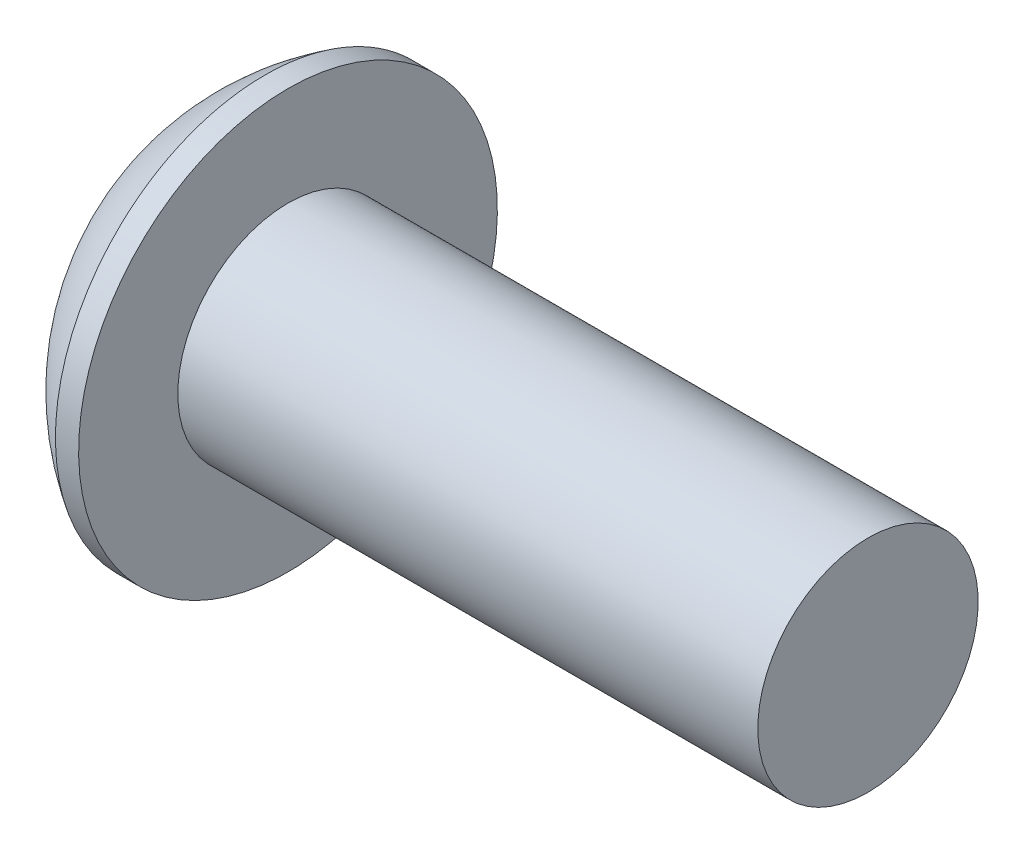
ISO-10303-21;
HEADER;
FILE_DESCRIPTION(('STEP AP214'),'2;1');
FILE_NAME('part.step','',(''),(''),'','','');
FILE_SCHEMA(('AUTOMOTIVE_DESIGN { 1 0 10303 214 1 1 1 1 }'));
ENDSEC;
DATA;
#1=APPLICATION_CONTEXT('core data for automotive mechanical design processes');
#2=APPLICATION_PROTOCOL_DEFINITION('international standard','automotive_design',2000,#1);
#3=PRODUCT_CONTEXT('',#1,'mechanical');
#4=PRODUCT('Part','Part','',(#3));
#5=PRODUCT_RELATED_PRODUCT_CATEGORY('part','',(#4));
#6=PRODUCT_DEFINITION_FORMATION('','',#4);
#7=PRODUCT_DEFINITION_CONTEXT('part definition',#1,'design');
#8=PRODUCT_DEFINITION('design','',#6,#7);
#9=PRODUCT_DEFINITION_SHAPE('','',#8);
#10=(LENGTH_UNIT() NAMED_UNIT(*) SI_UNIT(.MILLI.,.METRE.));
#11=(NAMED_UNIT(*) PLANE_ANGLE_UNIT() SI_UNIT($,.RADIAN.));
#12=(NAMED_UNIT(*) SI_UNIT($,.STERADIAN.) SOLID_ANGLE_UNIT());
#13=UNCERTAINTY_MEASURE_WITH_UNIT(LENGTH_MEASURE(1.E-05),#10,'distance_accuracy_value','');
#14=(GEOMETRIC_REPRESENTATION_CONTEXT(3) GLOBAL_UNCERTAINTY_ASSIGNED_CONTEXT((#13)) GLOBAL_UNIT_ASSIGNED_CONTEXT((#10,
#11,#12)) REPRESENTATION_CONTEXT('',''));
#15=CARTESIAN_POINT('',(0.,0.,0.));
#16=DIRECTION('',(0.,0.,1.));
#17=DIRECTION('',(1.,0.,0.));
#18=AXIS2_PLACEMENT_3D('',#15,#16,#17);
#19=CARTESIAN_POINT('',(-0.533400000000002,0.,0.));
#20=DIRECTION('',(-1.,0.,0.));
#21=DIRECTION('',(0.,0.,1.));
#22=AXIS2_PLACEMENT_3D('',#19,#20,#21);
#23=PLANE('',#22);
#24=DIRECTION('',(0.,0.5,0.866025403784439));
#25=VECTOR('',#24,1.);
#26=CARTESIAN_POINT('',(-0.533400000000002,1.83308710467706,0.));
#27=LINE('',#26,#25);
#28=CARTESIAN_POINT('',(-0.533400000000002,1.83308710467706,0.));
#29=VERTEX_POINT('',#28);
#30=CARTESIAN_POINT('',(-0.533400000000002,0.916543552338531,-1.5875));
#31=VERTEX_POINT('',#30);
#32=EDGE_CURVE('E115',#29,#31,#27,.F.);
#33=ORIENTED_EDGE('',*,*,#32,.T.);
#34=DIRECTION('',(0.,1.,0.));
#35=VECTOR('',#34,1.);
#36=CARTESIAN_POINT('',(-0.533400000000002,0.916543552338531,-1.5875));
#37=LINE('',#36,#35);
#38=CARTESIAN_POINT('',(-0.533400000000002,-0.916543552338531,-1.5875));
#39=VERTEX_POINT('',#38);
#40=EDGE_CURVE('E82',#31,#39,#37,.F.);
#41=ORIENTED_EDGE('',*,*,#40,.T.);
#42=DIRECTION('',(0.,0.5,-0.866025403784439));
#43=VECTOR('',#42,1.);
#44=CARTESIAN_POINT('',(-0.533400000000002,-0.916543552338531,-1.5875));
#45=LINE('',#44,#43);
#46=CARTESIAN_POINT('',(-0.533400000000002,-1.83308710467706,0.));
#47=VERTEX_POINT('',#46);
#48=EDGE_CURVE('E84',#39,#47,#45,.F.);
#49=ORIENTED_EDGE('',*,*,#48,.T.);
#50=DIRECTION('',(0.,-0.5,-0.866025403784439));
#51=VECTOR('',#50,1.);
#52=CARTESIAN_POINT('',(-0.533400000000002,-1.83308710467706,0.));
#53=LINE('',#52,#51);
#54=CARTESIAN_POINT('',(-0.533400000000002,-0.916543552338533,1.5875));
#55=VERTEX_POINT('',#54);
#56=EDGE_CURVE('E85',#47,#55,#53,.F.);
#57=ORIENTED_EDGE('',*,*,#56,.T.);
#58=DIRECTION('',(0.,-1.,0.));
#59=VECTOR('',#58,1.);
#60=CARTESIAN_POINT('',(-0.533400000000002,-0.916543552338532,1.5875));
#61=LINE('',#60,#59);
#62=CARTESIAN_POINT('',(-0.533400000000002,0.916543552338531,1.5875));
#63=VERTEX_POINT('',#62);
#64=EDGE_CURVE('E71',#55,#63,#61,.F.);
#65=ORIENTED_EDGE('',*,*,#64,.T.);
#66=DIRECTION('',(0.,-0.5,0.866025403784439));
#67=VECTOR('',#66,1.);
#68=CARTESIAN_POINT('',(-0.533400000000002,0.916543552338531,1.5875));
#69=LINE('',#68,#67);
#70=EDGE_CURVE('E110',#63,#29,#69,.F.);
#71=ORIENTED_EDGE('',*,*,#70,.T.);
#72=EDGE_LOOP('',(#33,#41,#49,#57,#65,#71));
#73=FACE_BOUND('',#72,.T.);
#74=ADVANCED_FACE('F17',(#73),#23,.T.);
#75=CARTESIAN_POINT('',(-0.533400000000002,-1.83308710467706,0.));
#76=DIRECTION('',(0.,-0.866025403784439,0.5));
#77=DIRECTION('',(0.,-0.5,-0.866025403784439));
#78=AXIS2_PLACEMENT_3D('',#75,#76,#77);
#79=PLANE('',#78);
#80=CARTESIAN_POINT('',(-2.56539999994394,-1.8330871046745,-2.00804498786736E-11));
#81=CARTESIAN_POINT('',(-2.53392818229741,-1.80158505518366,0.0545631502562923));
#82=CARTESIAN_POINT('',(-2.5043050627177,-1.76955629074211,0.110038597579172));
#83=CARTESIAN_POINT('',(-2.45006639539122,-1.70424635317817,0.223158727683824));
#84=CARTESIAN_POINT('',(-2.42548101615987,-1.6709589724711,0.280814162317604));
#85=CARTESIAN_POINT('',(-2.38336609605347,-1.60383660211837,0.397073518091736));
#86=CARTESIAN_POINT('',(-2.36573072948629,-1.57001869730198,0.455647847439699));
#87=CARTESIAN_POINT('',(-2.33856008862263,-1.50163859306838,0.574085662199493));
#88=CARTESIAN_POINT('',(-2.32900454007239,-1.46707848106388,0.633945532106421));
#89=CARTESIAN_POINT('',(-2.32038274183869,-1.40751253669323,0.737116774157155));
#90=CARTESIAN_POINT('',(-2.31910682172836,-1.38258360390154,0.780294952330845));
#91=CARTESIAN_POINT('',(-2.32125913780735,-1.33276652395073,0.866580665890379));
#92=CARTESIAN_POINT('',(-2.32468902284537,-1.30787839414808,0.90968817121394));
#93=CARTESIAN_POINT('',(-2.33605631415915,-1.25834345643267,0.995485200086784));
#94=CARTESIAN_POINT('',(-2.34399762019329,-1.23369687609494,1.03817432946455));
#95=CARTESIAN_POINT('',(-2.36395627681902,-1.18481740842653,1.12283605091316));
#96=CARTESIAN_POINT('',(-2.37597537628367,-1.16058470328902,1.16480832741616));
#97=CARTESIAN_POINT('',(-2.41164383187845,-1.09853862948576,1.27227527965358));
#98=CARTESIAN_POINT('',(-2.43797770752625,-1.06110942924036,1.33710455616529));
#99=CARTESIAN_POINT('',(-2.48243061452926,-1.00607390269188,1.43242888436855));
#100=CARTESIAN_POINT('',(-2.49804835924321,-0.987937988038022,1.46384120999077));
#101=CARTESIAN_POINT('',(-2.53070945051393,-0.951999508520197,1.52608848246242));
#102=CARTESIAN_POINT('',(-2.54775211871235,-0.934196789917587,1.55692369559499));
#103=CARTESIAN_POINT('',(-2.56539999993807,-0.916543552329633,1.58750000001541));
#104=B_SPLINE_CURVE_WITH_KNOTS('',3,(#80,#81,#82,#83,#84,#85,#86,#87,#88,#89,#90,#91,#92,#93,
#94,#95,#96,#97,#98,#99,#100,#101,#102,#103),.UNSPECIFIED.,.F.,.F.,(4,2,2,2,2,2,2,2,2,2,2,4),
(0.,0.211427927732169,0.424087197148228,0.633370156422424,0.842126401515785,0.991537201098734,
1.14100036552056,1.29059292577265,1.44024972414947,1.67781721417335,1.79627069411587,
1.91466809995991),.UNSPECIFIED.);
#105=CARTESIAN_POINT('',(-2.56539999993857,-1.83308710468646,0.));
#106=VERTEX_POINT('',#105);
#107=CARTESIAN_POINT('',(-2.56539999993106,-0.916543552342318,1.5875));
#108=VERTEX_POINT('',#107);
#109=EDGE_CURVE('E20',#106,#108,#104,.T.);
#110=ORIENTED_EDGE('',*,*,#109,.T.);
#111=DIRECTION('',(1.,0.,0.));
#112=VECTOR('',#111,1.);
#113=CARTESIAN_POINT('',(-0.533400000000002,-0.916543552338533,1.5875));
#114=LINE('',#113,#112);
#115=EDGE_CURVE('E90',#108,#55,#114,.T.);
#116=ORIENTED_EDGE('',*,*,#115,.T.);
#117=ORIENTED_EDGE('',*,*,#56,.F.);
#118=DIRECTION('',(1.,0.,0.));
#119=VECTOR('',#118,1.);
#120=CARTESIAN_POINT('',(-0.533400000000002,-1.83308710467706,0.));
#121=LINE('',#120,#119);
#122=EDGE_CURVE('E58',#47,#106,#121,.F.);
#123=ORIENTED_EDGE('',*,*,#122,.T.);
#124=EDGE_LOOP('',(#110,#116,#117,#123));
#125=FACE_BOUND('',#124,.T.);
#126=ADVANCED_FACE('F89',(#125),#79,.F.);
#127=CARTESIAN_POINT('',(-0.533400000000002,-0.916543552338531,-1.5875));
#128=DIRECTION('',(0.,-0.866025403784439,-0.5));
#129=DIRECTION('',(0.,0.5,-0.866025403784439));
#130=AXIS2_PLACEMENT_3D('',#127,#128,#129);
#131=PLANE('',#130);
#132=CARTESIAN_POINT('',(-2.56539999994527,-0.916543552319403,-1.58750000001409));
#133=CARTESIAN_POINT('',(-2.53392818229919,-0.948045601822691,-1.53293684974403));
#134=CARTESIAN_POINT('',(-2.50430506271949,-0.980074366269487,-1.47746140242354));
#135=CARTESIAN_POINT('',(-2.45006639539264,-1.04538430383757,-1.36434127232016));
#136=CARTESIAN_POINT('',(-2.42548101616093,-1.07867168454351,-1.30668583768523));
#137=CARTESIAN_POINT('',(-2.38336609605398,-1.14579405489574,-1.19042648190974));
#138=CARTESIAN_POINT('',(-2.36573072948662,-1.17961195971273,-1.13185215256154));
#139=CARTESIAN_POINT('',(-2.3385600886227,-1.2479920639471,-1.013414337801));
#140=CARTESIAN_POINT('',(-2.32900454007237,-1.28255217595175,-0.953554467893575));
#141=CARTESIAN_POINT('',(-2.32038274183866,-1.34211812032265,-0.850383225842316));
#142=CARTESIAN_POINT('',(-2.31910682172835,-1.36704705311438,-0.807205047668587));
#143=CARTESIAN_POINT('',(-2.32125913780739,-1.41686413306525,-0.720919334108961));
#144=CARTESIAN_POINT('',(-2.32468902284544,-1.44175226286793,-0.67781182878535));
#145=CARTESIAN_POINT('',(-2.33605631415929,-1.49128720058339,-0.592014799912417));
#146=CARTESIAN_POINT('',(-2.34399762019345,-1.51593378092113,-0.54932567053461));
#147=CARTESIAN_POINT('',(-2.36395627681926,-1.56481324858959,-0.464663949085931));
#148=CARTESIAN_POINT('',(-2.37597537628395,-1.58904595372712,-0.422691672582891));
#149=CARTESIAN_POINT('',(-2.41164383187876,-1.65109202753029,-0.315224720345625));
#150=CARTESIAN_POINT('',(-2.43797770752652,-1.6885212277756,-0.250395443834082));
#151=CARTESIAN_POINT('',(-2.48243061452944,-1.74355675432393,-0.15507111563107));
#152=CARTESIAN_POINT('',(-2.49804835924337,-1.76169266897775,-0.123658790008927));
#153=CARTESIAN_POINT('',(-2.53070945051401,-1.79763114849548,-0.0614115175374324));
#154=CARTESIAN_POINT('',(-2.5477521187124,-1.81543386709805,-0.0305763044049344));
#155=CARTESIAN_POINT('',(-2.56539999993807,-1.83308710468596,1.54136844652939E-11));
#156=B_SPLINE_CURVE_WITH_KNOTS('',3,(#132,#133,#134,#135,#136,#137,#138,#139,#140,#141,#142,
#143,#144,#145,#146,#147,#148,#149,#150,#151,#152,#153,#154,#155),.UNSPECIFIED.,.F.,.F.,(4,2,2,
2,2,2,2,2,2,2,2,4),(0.,0.211427927733669,0.424087197151313,0.633370156427101,0.842126401522016,
0.99153720110513,1.14100036552713,1.29059292577937,1.44024972415633,1.67781721417961,
1.79627069412184,1.9146680999656),.UNSPECIFIED.);
#157=CARTESIAN_POINT('',(-2.56539999995198,-0.916543552351339,-1.58750000002218));
#158=VERTEX_POINT('',#157);
#159=EDGE_CURVE('E94',#158,#106,#156,.T.);
#160=ORIENTED_EDGE('',*,*,#159,.T.);
#161=ORIENTED_EDGE('',*,*,#122,.F.);
#162=ORIENTED_EDGE('',*,*,#48,.F.);
#163=DIRECTION('',(-1.,0.,0.));
#164=VECTOR('',#163,1.);
#165=CARTESIAN_POINT('',(-0.533400000000002,-0.916543552338531,-1.5875));
#166=LINE('',#165,#164);
#167=EDGE_CURVE('E96',#39,#158,#166,.T.);
#168=ORIENTED_EDGE('',*,*,#167,.T.);
#169=EDGE_LOOP('',(#160,#161,#162,#168));
#170=FACE_BOUND('',#169,.T.);
#171=ADVANCED_FACE('F92',(#170),#131,.F.);
#172=CARTESIAN_POINT('',(-0.533400000000002,0.916543552338531,-1.5875));
#173=DIRECTION('',(0.,0.,-1.));
#174=DIRECTION('',(-1.,0.,0.));
#175=AXIS2_PLACEMENT_3D('',#172,#173,#174);
#176=PLANE('',#175);
#177=CARTESIAN_POINT('',(-2.56539999994527,0.916543552360294,-1.58749999999048));
#178=CARTESIAN_POINT('',(-2.53392818229821,0.853539453376781,-1.58749999999657));
#179=CARTESIAN_POINT('',(-2.50430506271702,0.789481924500113,-1.58749999999908));
#180=CARTESIAN_POINT('',(-2.45006639538581,0.658862049392287,-1.58750000000093));
#181=CARTESIAN_POINT('',(-2.42548101615122,0.59228728799181,-1.58750000000025));
#182=CARTESIAN_POINT('',(-2.38336609603683,0.458042547310979,-1.58749999999976));
#183=CARTESIAN_POINT('',(-2.36573072946494,0.390406737689213,-1.58749999999994));
#184=CARTESIAN_POINT('',(-2.3385600885904,0.253646529243895,-1.58750000000006));
#185=CARTESIAN_POINT('',(-2.32900454003397,0.184526305245804,-1.58750000000001));
#186=CARTESIAN_POINT('',(-2.32038274178942,0.0653944165301613,-1.58749999999999));
#187=CARTESIAN_POINT('',(-2.31910682167392,0.0155365509618711,-1.5875));
#188=CARTESIAN_POINT('',(-2.3212591377409,-0.0840976089101244,-1.5875));
#189=CARTESIAN_POINT('',(-2.32468902277208,-0.133873868500894,-1.5875));
#190=CARTESIAN_POINT('',(-2.33605631407098,-0.2329437439033,-1.5875));
#191=CARTESIAN_POINT('',(-2.34399762009707,-0.282236904564879,-1.5875));
#192=CARTESIAN_POINT('',(-2.36395627670599,-0.379995839874564,-1.5875));
#193=CARTESIAN_POINT('',(-2.37597537616188,-0.428461250136325,-1.5875));
#194=CARTESIAN_POINT('',(-2.41164383175616,-0.552553397787632,-1.5875));
#195=CARTESIAN_POINT('',(-2.43797770742117,-0.627411798334259,-1.5875));
#196=CARTESIAN_POINT('',(-2.48243061445881,-0.737482851511091,-1.5875));
#197=CARTESIAN_POINT('',(-2.49804835918582,-0.773754680844889,-1.5875));
#198=CARTESIAN_POINT('',(-2.53070945048496,-0.845631639931401,-1.5875));
#199=CARTESIAN_POINT('',(-2.54775211869874,-0.881237077161412,-1.5875));
#200=CARTESIAN_POINT('',(-2.56539999994071,-0.916543552361606,-1.5875));
#201=B_SPLINE_CURVE_WITH_KNOTS('',3,(#177,#178,#179,#180,#181,#182,#183,#184,#185,#186,#187,
#188,#189,#190,#191,#192,#193,#194,#195,#196,#197,#198,#199,#200),.UNSPECIFIED.,.F.,.F.,(4,2,2,
2,2,2,2,2,2,2,2,4),(0.,0.211427927701375,0.424087197086717,0.633370156331471,0.842126401395377,
0.991537200933545,1.14100036531054,1.29059292551773,1.44024972384963,1.677817214047,
1.79627069407681,1.91466810000777),.UNSPECIFIED.);
#202=CARTESIAN_POINT('',(-2.56539999995198,0.916543552337129,-1.58749999999757));
#203=VERTEX_POINT('',#202);
#204=EDGE_CURVE('E198',#203,#158,#201,.T.);
#205=ORIENTED_EDGE('',*,*,#204,.T.);
#206=ORIENTED_EDGE('',*,*,#167,.F.);
#207=ORIENTED_EDGE('',*,*,#40,.F.);
#208=DIRECTION('',(1.,0.,0.));
#209=VECTOR('',#208,1.);
#210=CARTESIAN_POINT('',(-0.533400000000002,0.916543552338531,-1.5875));
#211=LINE('',#210,#209);
#212=EDGE_CURVE('E112',#31,#203,#211,.F.);
#213=ORIENTED_EDGE('',*,*,#212,.T.);
#214=EDGE_LOOP('',(#205,#206,#207,#213));
#215=FACE_BOUND('',#214,.T.);
#216=ADVANCED_FACE('F188',(#215),#176,.F.);
#217=CARTESIAN_POINT('',(-0.533400000000002,1.83308710467706,0.));
#218=DIRECTION('',(0.,0.866025403784439,-0.5));
#219=DIRECTION('',(0.,0.5,0.866025403784439));
#220=AXIS2_PLACEMENT_3D('',#217,#218,#219);
#221=PLANE('',#220);
#222=CARTESIAN_POINT('',(-2.56539999994394,1.8330871046745,2.00800374309997E-11));
#223=CARTESIAN_POINT('',(-2.5339281822974,1.80158505518366,-0.0545631502562965));
#224=CARTESIAN_POINT('',(-2.5043050627177,1.76955629074211,-0.11003859757918));
#225=CARTESIAN_POINT('',(-2.45006639539121,1.70424635317816,-0.22315872768384));
#226=CARTESIAN_POINT('',(-2.42548101615987,1.67095897247109,-0.280814162317626));
#227=CARTESIAN_POINT('',(-2.38336609605347,1.60383660211835,-0.397073518091758));
#228=CARTESIAN_POINT('',(-2.36573072948628,1.57001869730197,-0.455647847439717));
#229=CARTESIAN_POINT('',(-2.33856008862263,1.50163859306837,-0.574085662199503));
#230=CARTESIAN_POINT('',(-2.32900454007239,1.46707848106388,-0.633945532106426));
#231=CARTESIAN_POINT('',(-2.32038274183869,1.40751253669322,-0.737116774157154));
#232=CARTESIAN_POINT('',(-2.31910682172836,1.38258360390154,-0.780294952330843));
#233=CARTESIAN_POINT('',(-2.32125913780735,1.33276652395073,-0.866580665890374));
#234=CARTESIAN_POINT('',(-2.32468902284537,1.30787839414808,-0.909688171213933));
#235=CARTESIAN_POINT('',(-2.33605631415915,1.25834345643267,-0.995485200086777));
#236=CARTESIAN_POINT('',(-2.34399762019328,1.23369687609495,-1.03817432946455));
#237=CARTESIAN_POINT('',(-2.36395627681902,1.18481740842653,-1.12283605091316));
#238=CARTESIAN_POINT('',(-2.37597537628367,1.16058470328902,-1.16480832741616));
#239=CARTESIAN_POINT('',(-2.41164383187872,1.09853862948529,-1.2722752796544));
#240=CARTESIAN_POINT('',(-2.43797770752691,1.06110942923942,-1.33710455616691));
#241=CARTESIAN_POINT('',(-2.48243061453059,1.00607390269029,-1.43242888437131));
#242=CARTESIAN_POINT('',(-2.49804835924479,0.987937988036214,-1.4638412099939));
#243=CARTESIAN_POINT('',(-2.53070945051602,0.951999508517968,-1.52608848246628));
#244=CARTESIAN_POINT('',(-2.54775211871471,0.934196789915152,-1.55692369559921));
#245=CARTESIAN_POINT('',(-2.56539999994071,0.916543552326994,-1.58750000001998));
#246=B_SPLINE_CURVE_WITH_KNOTS('',3,(#222,#223,#224,#225,#226,#227,#228,#229,#230,#231,#232,
#233,#234,#235,#236,#237,#238,#239,#240,#241,#242,#243,#244,#245),.UNSPECIFIED.,.F.,.F.,(4,2,2,
2,2,2,2,2,2,2,2,4),(0.,0.211427927732185,0.424087197148259,0.63337015642244,0.842126401515786,
0.99153720109873,1.14100036552055,1.29059292577265,1.44024972414947,1.67781721417631,
1.7962706941203,1.9146680999658),.UNSPECIFIED.);
#247=CARTESIAN_POINT('',(-2.56539999993857,1.83308710468646,0.));
#248=VERTEX_POINT('',#247);
#249=EDGE_CURVE('E192',#248,#203,#246,.T.);
#250=ORIENTED_EDGE('',*,*,#249,.T.);
#251=ORIENTED_EDGE('',*,*,#212,.F.);
#252=ORIENTED_EDGE('',*,*,#32,.F.);
#253=DIRECTION('',(1.,0.,0.));
#254=VECTOR('',#253,1.);
#255=CARTESIAN_POINT('',(-0.533400000000002,1.83308710467706,0.));
#256=LINE('',#255,#254);
#257=EDGE_CURVE('E107',#29,#248,#256,.F.);
#258=ORIENTED_EDGE('',*,*,#257,.T.);
#259=EDGE_LOOP('',(#250,#251,#252,#258));
#260=FACE_BOUND('',#259,.T.);
#261=ADVANCED_FACE('F184',(#260),#221,.F.);
#262=CARTESIAN_POINT('',(-0.533400000000002,0.916543552338531,1.5875));
#263=DIRECTION('',(0.,0.866025403784439,0.5));
#264=DIRECTION('',(0.,-0.5,0.866025403784439));
#265=AXIS2_PLACEMENT_3D('',#262,#263,#264);
#266=PLANE('',#265);
#267=CARTESIAN_POINT('',(-2.56539999994394,0.91654355231986,1.58750000000782));
#268=CARTESIAN_POINT('',(-2.53392818229741,0.948045601824288,1.5329368497393));
#269=CARTESIAN_POINT('',(-2.5043050627177,0.980074366271431,1.47746140241964));
#270=CARTESIAN_POINT('',(-2.45006639539122,1.04538430383949,1.36434127231737));
#271=CARTESIAN_POINT('',(-2.42548101615987,1.07867168454504,1.30668583768271));
#272=CARTESIAN_POINT('',(-2.38336609605347,1.14579405489669,1.19042648190795));
#273=CARTESIAN_POINT('',(-2.36573072948629,1.17961195971347,1.13185215256022));
#274=CARTESIAN_POINT('',(-2.33856008862263,1.24799206394736,1.01341433780059));
#275=CARTESIAN_POINT('',(-2.32900454007239,1.28255217595174,0.953554467893597));
#276=CARTESIAN_POINT('',(-2.32038274183869,1.34211812032234,0.850383225842832));
#277=CARTESIAN_POINT('',(-2.31910682172836,1.36704705311405,0.807205047669152));
#278=CARTESIAN_POINT('',(-2.32125913780735,1.41686413306487,0.720919334109624));
#279=CARTESIAN_POINT('',(-2.32468902284537,1.44175226286752,0.677811828786061));
#280=CARTESIAN_POINT('',(-2.33605631415915,1.49128720058292,0.592014799913215));
#281=CARTESIAN_POINT('',(-2.34399762019328,1.51593378092065,0.549325670535446));
#282=CARTESIAN_POINT('',(-2.36395627681902,1.56481324858906,0.464663949086841));
#283=CARTESIAN_POINT('',(-2.37597537628367,1.58904595372657,0.422691672583837));
#284=CARTESIAN_POINT('',(-2.41164383187845,1.65109202752983,0.315224720346425));
#285=CARTESIAN_POINT('',(-2.43797770752625,1.68852122777524,0.250395443834706));
#286=CARTESIAN_POINT('',(-2.48243061452926,1.74355675432371,0.155071115631445));
#287=CARTESIAN_POINT('',(-2.49804835924321,1.76169266897757,0.123658790009225));
#288=CARTESIAN_POINT('',(-2.53070945051393,1.7976311484954,0.0614115175375789));
#289=CARTESIAN_POINT('',(-2.54775211871235,1.81543386709801,0.0305763044050067));
#290=CARTESIAN_POINT('',(-2.56539999993807,1.83308710468596,-1.54142580803093E-11));
#291=B_SPLINE_CURVE_WITH_KNOTS('',3,(#267,#268,#269,#270,#271,#272,#273,#274,#275,#276,#277,
#278,#279,#280,#281,#282,#283,#284,#285,#286,#287,#288,#289,#290),.UNSPECIFIED.,.F.,.F.,(4,2,2,
2,2,2,2,2,2,2,2,4),(0.,0.211427927732169,0.424087197148227,0.633370156422423,0.842126401515785,
0.991537201098733,1.14100036552056,1.29059292577265,1.44024972414946,1.67781721417335,
1.79627069411587,1.91466809995991),.UNSPECIFIED.);
#292=CARTESIAN_POINT('',(-2.56539999993857,0.91654355234323,1.58750000000814));
#293=VERTEX_POINT('',#292);
#294=EDGE_CURVE('E166',#293,#248,#291,.T.);
#295=ORIENTED_EDGE('',*,*,#294,.T.);
#296=ORIENTED_EDGE('',*,*,#257,.F.);
#297=ORIENTED_EDGE('',*,*,#70,.F.);
#298=DIRECTION('',(1.,0.,0.));
#299=VECTOR('',#298,1.);
#300=CARTESIAN_POINT('',(-0.533400000000002,0.916543552338531,1.5875));
#301=LINE('',#300,#299);
#302=EDGE_CURVE('E39',#63,#293,#301,.F.);
#303=ORIENTED_EDGE('',*,*,#302,.T.);
#304=EDGE_LOOP('',(#295,#296,#297,#303));
#305=FACE_BOUND('',#304,.T.);
#306=ADVANCED_FACE('F177',(#305),#266,.F.);
#307=CARTESIAN_POINT('',(-0.533400000000002,-0.916543552338532,1.5875));
#308=DIRECTION('',(0.,0.,1.));
#309=DIRECTION('',(0.,-1.,0.));
#310=AXIS2_PLACEMENT_3D('',#307,#308,#309);
#311=PLANE('',#310);
#312=CARTESIAN_POINT('',(-2.56539999994394,-0.916543552354642,1.58749999998774));
#313=CARTESIAN_POINT('',(-2.53392818229741,-0.853539453359365,1.58749999999559));
#314=CARTESIAN_POINT('',(-2.50430506271771,-0.789481924470656,1.58749999999882));
#315=CARTESIAN_POINT('',(-2.45006639539122,-0.658862049338629,1.58750000000119));
#316=CARTESIAN_POINT('',(-2.42548101615988,-0.592287287925995,1.58750000000032));
#317=CARTESIAN_POINT('',(-2.38336609605349,-0.458042547221593,1.58749999999969));
#318=CARTESIAN_POINT('',(-2.36573072948631,-0.390406737588416,1.58749999999992));
#319=CARTESIAN_POINT('',(-2.33856008862266,-0.253646529120892,1.58750000000008));
#320=CARTESIAN_POINT('',(-2.32900454007243,-0.184526305112002,1.58750000000002));
#321=CARTESIAN_POINT('',(-2.32038274183874,-0.065394416370719,1.58749999999999));
#322=CARTESIAN_POINT('',(-2.31910682172841,-0.0155365507873145,1.5875));
#323=CARTESIAN_POINT('',(-2.32125913780742,0.0840976091143436,1.5875));
#324=CARTESIAN_POINT('',(-2.32468902284545,0.133873868719661,1.5875));
#325=CARTESIAN_POINT('',(-2.33605631415924,0.232943744150505,1.5875));
#326=CARTESIAN_POINT('',(-2.34399762019338,0.282236904825971,1.5875));
#327=CARTESIAN_POINT('',(-2.36395627681913,0.379995840162817,1.5875));
#328=CARTESIAN_POINT('',(-2.37597537628379,0.428461250437852,1.5875));
#329=CARTESIAN_POINT('',(-2.41164383187857,0.552553398044325,1.5875));
#330=CARTESIAN_POINT('',(-2.43797770752636,0.627411798535089,1.5875));
#331=CARTESIAN_POINT('',(-2.48243061452933,0.737482851631955,1.5875));
#332=CARTESIAN_POINT('',(-2.49804835924327,0.773754680939651,1.5875));
#333=CARTESIAN_POINT('',(-2.53070945051396,0.84563163997525,1.5875));
#334=CARTESIAN_POINT('',(-2.54775211871237,0.881237077180446,1.5875));
#335=CARTESIAN_POINT('',(-2.56539999993807,0.91654355235633,1.5875));
#336=B_SPLINE_CURVE_WITH_KNOTS('',3,(#312,#313,#314,#315,#316,#317,#318,#319,#320,#321,#322,
#323,#324,#325,#326,#327,#328,#329,#330,#331,#332,#333,#334,#335),.UNSPECIFIED.,.F.,.F.,(4,2,2,
2,2,2,2,2,2,2,2,4),(0.,0.211427927732202,0.424087197148294,0.633370156422521,0.842126401515914,
0.991537201098908,1.14100036552078,1.29059292577292,1.44024972414978,1.67781721417349,
1.79627069411592,1.91466809995988),.UNSPECIFIED.);
#337=EDGE_CURVE('E158',#108,#293,#336,.T.);
#338=ORIENTED_EDGE('',*,*,#337,.T.);
#339=ORIENTED_EDGE('',*,*,#302,.F.);
#340=ORIENTED_EDGE('',*,*,#64,.F.);
#341=ORIENTED_EDGE('',*,*,#115,.F.);
#342=EDGE_LOOP('',(#338,#339,#340,#341));
#343=FACE_BOUND('',#342,.T.);
#344=ADVANCED_FACE('F173',(#343),#311,.F.);
#345=CARTESIAN_POINT('',(-2.56540000003724,0.,0.));
#346=DIRECTION('',(-1.,0.,0.));
#347=DIRECTION('',(0.,-1.,0.));
#348=AXIS2_PLACEMENT_3D('',#345,#346,#347);
#349=CONICAL_SURFACE('',#348,1.83308710478514,0.78539816351237);
#350=ORIENTED_EDGE('',*,*,#109,.F.);
#351=CARTESIAN_POINT('',(-2.56539999992356,0.,0.));
#352=DIRECTION('',(-1.,0.,0.));
#353=DIRECTION('',(0.,-1.,0.));
#354=AXIS2_PLACEMENT_3D('',#351,#352,#353);
#355=CIRCLE('',#354,1.83308710467145);
#356=EDGE_CURVE('E165',#108,#106,#355,.F.);
#357=ORIENTED_EDGE('',*,*,#356,.F.);
#358=EDGE_LOOP('',(#350,#357));
#359=FACE_BOUND('',#358,.T.);
#360=ADVANCED_FACE('F176',(#359),#349,.F.);
#361=CARTESIAN_POINT('',(-2.56540000003724,0.,0.));
#362=DIRECTION('',(-1.,0.,0.));
#363=DIRECTION('',(0.,-1.,0.));
#364=AXIS2_PLACEMENT_3D('',#361,#362,#363);
#365=CONICAL_SURFACE('',#364,1.83308710478514,0.78539816351237);
#366=ORIENTED_EDGE('',*,*,#159,.F.);
#367=CARTESIAN_POINT('',(-2.56539999992356,0.,0.));
#368=DIRECTION('',(-1.,0.,0.));
#369=DIRECTION('',(0.,-1.,0.));
#370=AXIS2_PLACEMENT_3D('',#367,#368,#369);
#371=CIRCLE('',#370,1.83308710467145);
#372=EDGE_CURVE('E273',#106,#158,#371,.F.);
#373=ORIENTED_EDGE('',*,*,#372,.F.);
#374=EDGE_LOOP('',(#366,#373));
#375=FACE_BOUND('',#374,.T.);
#376=ADVANCED_FACE('F210',(#375),#365,.F.);
#377=CARTESIAN_POINT('',(-2.56540000003724,0.,0.));
#378=DIRECTION('',(-1.,0.,0.));
#379=DIRECTION('',(0.,-1.,0.));
#380=AXIS2_PLACEMENT_3D('',#377,#378,#379);
#381=CONICAL_SURFACE('',#380,1.83308710478514,0.785398163397448);
#382=ORIENTED_EDGE('',*,*,#204,.F.);
#383=CARTESIAN_POINT('',(-2.5653999999804,0.,0.));
#384=DIRECTION('',(-1.,0.,0.));
#385=DIRECTION('',(0.,-1.,0.));
#386=AXIS2_PLACEMENT_3D('',#383,#384,#385);
#387=CIRCLE('',#386,1.83308710472829);
#388=EDGE_CURVE('E270',#158,#203,#387,.F.);
#389=ORIENTED_EDGE('',*,*,#388,.F.);
#390=EDGE_LOOP('',(#382,#389));
#391=FACE_BOUND('',#390,.T.);
#392=ADVANCED_FACE('F206',(#391),#381,.F.);
#393=CARTESIAN_POINT('',(-2.56540000003724,0.,0.));
#394=DIRECTION('',(-1.,0.,0.));
#395=DIRECTION('',(0.,-1.,0.));
#396=AXIS2_PLACEMENT_3D('',#393,#394,#395);
#397=CONICAL_SURFACE('',#396,1.83308710478514,0.78539816351237);
#398=ORIENTED_EDGE('',*,*,#249,.F.);
#399=CARTESIAN_POINT('',(-2.56539999992356,0.,0.));
#400=DIRECTION('',(-1.,0.,0.));
#401=DIRECTION('',(0.,-1.,0.));
#402=AXIS2_PLACEMENT_3D('',#399,#400,#401);
#403=CIRCLE('',#402,1.83308710467145);
#404=EDGE_CURVE('E267',#203,#248,#403,.F.);
#405=ORIENTED_EDGE('',*,*,#404,.F.);
#406=EDGE_LOOP('',(#398,#405));
#407=FACE_BOUND('',#406,.T.);
#408=ADVANCED_FACE('F203',(#407),#397,.F.);
#409=CARTESIAN_POINT('',(-2.56540000003724,0.,0.));
#410=DIRECTION('',(-1.,0.,0.));
#411=DIRECTION('',(0.,-1.,0.));
#412=AXIS2_PLACEMENT_3D('',#409,#410,#411);
#413=CONICAL_SURFACE('',#412,1.83308710478514,0.78539816351237);
#414=ORIENTED_EDGE('',*,*,#294,.F.);
#415=CARTESIAN_POINT('',(-2.56539999992356,0.,0.));
#416=DIRECTION('',(-1.,0.,0.));
#417=DIRECTION('',(0.,-1.,0.));
#418=AXIS2_PLACEMENT_3D('',#415,#416,#417);
#419=CIRCLE('',#418,1.83308710467145);
#420=EDGE_CURVE('E262',#248,#293,#419,.F.);
#421=ORIENTED_EDGE('',*,*,#420,.F.);
#422=EDGE_LOOP('',(#414,#421));
#423=FACE_BOUND('',#422,.T.);
#424=ADVANCED_FACE('F153',(#423),#413,.F.);
#425=CARTESIAN_POINT('',(-2.56540000003724,0.,0.));
#426=DIRECTION('',(-1.,0.,0.));
#427=DIRECTION('',(0.,-1.,0.));
#428=AXIS2_PLACEMENT_3D('',#425,#426,#427);
#429=CONICAL_SURFACE('',#428,1.83308710478514,0.785398163512485);
#430=ORIENTED_EDGE('',*,*,#337,.F.);
#431=CARTESIAN_POINT('',(-2.56539999992356,0.,0.));
#432=DIRECTION('',(-1.,0.,0.));
#433=DIRECTION('',(0.,-1.,0.));
#434=AXIS2_PLACEMENT_3D('',#431,#432,#433);
#435=CIRCLE('',#434,1.83308710467145);
#436=EDGE_CURVE('E138',#293,#108,#435,.F.);
#437=ORIENTED_EDGE('',*,*,#436,.F.);
#438=EDGE_LOOP('',(#430,#437));
#439=FACE_BOUND('',#438,.T.);
#440=ADVANCED_FACE('F148',(#439),#429,.F.);
#441=CARTESIAN_POINT('',(-2.5654,0.,0.));
#442=DIRECTION('',(-1.,0.,0.));
#443=DIRECTION('',(0.,-1.,0.));
#444=AXIS2_PLACEMENT_3D('',#441,#442,#443);
#445=PLANE('',#444);
#446=CARTESIAN_POINT('',(-2.5654,-2.29235000000002,0.));
#447=CARTESIAN_POINT('',(-2.56540000000001,-2.29234961429958,-0.0643619991867162));
#448=CARTESIAN_POINT('',(-2.56540000000002,-2.28963695190109,-0.128735826629366));
#449=CARTESIAN_POINT('',(-2.56539999999999,-2.27880393843649,-0.257038618985287));
#450=CARTESIAN_POINT('',(-2.56539999999995,-2.27068199085128,-0.320967446929163));
#451=CARTESIAN_POINT('',(-2.56540000000006,-2.24906694794257,-0.448021254607718));
#452=CARTESIAN_POINT('',(-2.56540000000021,-2.23556532653462,-0.511144793381861));
#453=CARTESIAN_POINT('',(-2.56539999999979,-2.20328400495645,-0.636065176149322));
#454=CARTESIAN_POINT('',(-2.56539999999921,-2.18450002159115,-0.697860899533935));
#455=CARTESIAN_POINT('',(-2.56539999999869,-2.12048422735804,-0.88032980292775));
#456=CARTESIAN_POINT('',(-2.56539999999995,-2.0675359907946,-0.99839179592812));
#457=CARTESIAN_POINT('',(-2.56540000000006,-1.94254204858674,-1.22393765942148));
#458=CARTESIAN_POINT('',(-2.56539999999891,-1.87049561696644,-1.33142112758208));
#459=CARTESIAN_POINT('',(-2.56539999999932,-1.74974254194881,-1.48237719670935));
#460=CARTESIAN_POINT('',(-2.56539999999982,-1.70734573132302,-1.53101280076738));
#461=CARTESIAN_POINT('',(-2.56540000000018,-1.6186391029153,-1.62450601319185));
#462=CARTESIAN_POINT('',(-2.56540000000005,-1.57233309727313,-1.66936721890417));
#463=CARTESIAN_POINT('',(-2.56539999999995,-1.47608431707234,-1.7550488420402));
#464=CARTESIAN_POINT('',(-2.56539999999999,-1.42613990458995,-1.79586741981512));
#465=CARTESIAN_POINT('',(-2.56540000000002,-1.32299452541252,-1.87315615311523));
#466=CARTESIAN_POINT('',(-2.56540000000001,-1.26979280714188,-1.90962529930697));
#467=CARTESIAN_POINT('',(-2.56539999999999,-1.10588180153953,-2.0120772215109));
#468=CARTESIAN_POINT('',(-2.5654,-0.990764947001321,-2.07119486286667));
#469=CARTESIAN_POINT('',(-2.5654,-0.752302198839727,-2.16922858468856));
#470=CARTESIAN_POINT('',(-2.5654,-0.628956393121269,-2.2081448809145));
#471=CARTESIAN_POINT('',(-2.5654,-0.377466101733277,-2.2647275576592));
#472=CARTESIAN_POINT('',(-2.5654,-0.249321590440388,-2.28239382469379));
#473=CARTESIAN_POINT('',(-2.5654,0.0081143537161001,-2.29595665980956));
#474=CARTESIAN_POINT('',(-2.5654,0.137405786579698,-2.29185322789073));
#475=CARTESIAN_POINT('',(-2.5654,0.393449386933719,-2.2620096240906));
#476=CARTESIAN_POINT('',(-2.5654,0.520201567981077,-2.23626956775766));
#477=CARTESIAN_POINT('',(-2.5654,0.767645294384444,-2.16383549332687));
#478=CARTESIAN_POINT('',(-2.5654,0.888336774993549,-2.11714125142686));
#479=CARTESIAN_POINT('',(-2.5654,1.06210572146655,-2.03247976453654));
#480=CARTESIAN_POINT('',(-2.5654,1.11884498714066,-2.00180278323696));
#481=CARTESIAN_POINT('',(-2.5654,1.22954062855572,-1.93578011658036));
#482=CARTESIAN_POINT('',(-2.5654,1.28349764565392,-1.9004355139425));
#483=CARTESIAN_POINT('',(-2.5654,1.38821676641537,-1.82534174602348));
#484=CARTESIAN_POINT('',(-2.5654,1.43898030563028,-1.78559458231503));
#485=CARTESIAN_POINT('',(-2.5654,1.53701984534431,-1.70193996292362));
#486=CARTESIAN_POINT('',(-2.5654,1.5842924328055,-1.65802852924127));
#487=CARTESIAN_POINT('',(-2.5654,1.72023903553758,-1.52059650554139));
#488=CARTESIAN_POINT('',(-2.5654,1.80318066138239,-1.42127847626519));
#489=CARTESIAN_POINT('',(-2.5654,1.95118232345098,-1.21011519784664));
#490=CARTESIAN_POINT('',(-2.5654,2.01624303935584,-1.09827042509272));
#491=CARTESIAN_POINT('',(-2.5654,2.09907772661314,-0.923538238005839));
#492=CARTESIAN_POINT('',(-2.5654,2.12425103063558,-0.864058373981966));
#493=CARTESIAN_POINT('',(-2.5654,2.16947990046565,-0.743221562175601));
#494=CARTESIAN_POINT('',(-2.5654,2.18953960800684,-0.681866178863365));
#495=CARTESIAN_POINT('',(-2.5654,2.22438542051156,-0.557786972400356));
#496=CARTESIAN_POINT('',(-2.5654,2.23917985294818,-0.495065478128172));
#497=CARTESIAN_POINT('',(-2.5654,2.26343456384453,-0.368611258323514));
#498=CARTESIAN_POINT('',(-2.5654,2.27289641559285,-0.304878836759566));
#499=CARTESIAN_POINT('',(-2.5654,2.28388649696736,-0.200873029360621));
#500=CARTESIAN_POINT('',(-2.5654,2.28705930623293,-0.160766164180096));
#501=CARTESIAN_POINT('',(-2.5654,2.29129117827044,-0.0804410725432706));
#502=CARTESIAN_POINT('',(-2.5654,2.29235024104238,-0.0402228460869715));
#503=CARTESIAN_POINT('',(-2.56540000000001,2.29234961429956,0.0643619991867166));
#504=CARTESIAN_POINT('',(-2.56540000000002,2.28963695190107,0.128735826629366));
#505=CARTESIAN_POINT('',(-2.56539999999999,2.27880393843648,0.257038618985288));
#506=CARTESIAN_POINT('',(-2.56539999999995,2.27068199085126,0.320967446929163));
#507=CARTESIAN_POINT('',(-2.56540000000006,2.24906694794255,0.448021254607719));
#508=CARTESIAN_POINT('',(-2.56540000000021,2.2355653265346,0.511144793381862));
#509=CARTESIAN_POINT('',(-2.56539999999979,2.20328400495644,0.636065176149322));
#510=CARTESIAN_POINT('',(-2.56539999999921,2.18450002159113,0.697860899533936));
#511=CARTESIAN_POINT('',(-2.56539999999869,2.12048422735802,0.88032980292775));
#512=CARTESIAN_POINT('',(-2.56539999999995,2.06753599079459,0.998391795928119));
#513=CARTESIAN_POINT('',(-2.56540000000006,1.94254204858672,1.22393765942147));
#514=CARTESIAN_POINT('',(-2.56539999999891,1.87049561696642,1.33142112758208));
#515=CARTESIAN_POINT('',(-2.56539999999933,1.7497425419488,1.48237719670935));
#516=CARTESIAN_POINT('',(-2.56539999999982,1.707345731323,1.53101280076738));
#517=CARTESIAN_POINT('',(-2.56540000000018,1.61863910291529,1.62450601319185));
#518=CARTESIAN_POINT('',(-2.56540000000005,1.57233309727312,1.66936721890418));
#519=CARTESIAN_POINT('',(-2.56539999999995,1.47608431707233,1.75504884204021));
#520=CARTESIAN_POINT('',(-2.56539999999999,1.42613990458993,1.79586741981512));
#521=CARTESIAN_POINT('',(-2.56540000000002,1.3229945254125,1.87315615311523));
#522=CARTESIAN_POINT('',(-2.56540000000001,1.26979280714187,1.90962529930697));
#523=CARTESIAN_POINT('',(-2.56539999999999,1.10588180153952,2.0120772215109));
#524=CARTESIAN_POINT('',(-2.5654,0.990764947001304,2.07119486286667));
#525=CARTESIAN_POINT('',(-2.5654,0.75230219883971,2.16922858468856));
#526=CARTESIAN_POINT('',(-2.5654,0.628956393121252,2.2081448809145));
#527=CARTESIAN_POINT('',(-2.5654,0.377466101733262,2.2647275576592));
#528=CARTESIAN_POINT('',(-2.5654,0.249321590440372,2.28239382469379));
#529=CARTESIAN_POINT('',(-2.5654,-0.00811435371611611,2.29595665980955));
#530=CARTESIAN_POINT('',(-2.5654,-0.137405786579714,2.29185322789072));
#531=CARTESIAN_POINT('',(-2.5654,-0.393449386933735,2.2620096240906));
#532=CARTESIAN_POINT('',(-2.5654,-0.520201567981094,2.23626956775766));
#533=CARTESIAN_POINT('',(-2.5654,-0.767645294384462,2.16383549332688));
#534=CARTESIAN_POINT('',(-2.5654,-0.888336774993567,2.11714125142686));
#535=CARTESIAN_POINT('',(-2.5654,-1.06210572146657,2.03247976453654));
#536=CARTESIAN_POINT('',(-2.5654,-1.11884498714068,2.00180278323695));
#537=CARTESIAN_POINT('',(-2.5654,-1.22954062855574,1.93578011658036));
#538=CARTESIAN_POINT('',(-2.5654,-1.28349764565394,1.9004355139425));
#539=CARTESIAN_POINT('',(-2.5654,-1.38821676641539,1.82534174602348));
#540=CARTESIAN_POINT('',(-2.5654,-1.4389803056303,1.78559458231503));
#541=CARTESIAN_POINT('',(-2.5654,-1.53701984534432,1.70193996292362));
#542=CARTESIAN_POINT('',(-2.5654,-1.58429243280552,1.65802852924127));
#543=CARTESIAN_POINT('',(-2.5654,-1.7202390355376,1.52059650554139));
#544=CARTESIAN_POINT('',(-2.5654,-1.8031806613824,1.42127847626519));
#545=CARTESIAN_POINT('',(-2.5654,-1.951182323451,1.21011519784664));
#546=CARTESIAN_POINT('',(-2.5654,-2.01624303935586,1.09827042509272));
#547=CARTESIAN_POINT('',(-2.5654,-2.09907772661316,0.923538238005837));
#548=CARTESIAN_POINT('',(-2.5654,-2.1242510306356,0.864058373981964));
#549=CARTESIAN_POINT('',(-2.5654,-2.16947990046567,0.743221562175599));
#550=CARTESIAN_POINT('',(-2.5654,-2.18953960800686,0.681866178863365));
#551=CARTESIAN_POINT('',(-2.5654,-2.22438542051158,0.557786972400357));
#552=CARTESIAN_POINT('',(-2.5654,-2.2391798529482,0.495065478128172));
#553=CARTESIAN_POINT('',(-2.5654,-2.26343456384455,0.368611258323514));
#554=CARTESIAN_POINT('',(-2.5654,-2.27289641559287,0.304878836759567));
#555=CARTESIAN_POINT('',(-2.5654,-2.28388649696738,0.200873029360623));
#556=CARTESIAN_POINT('',(-2.5654,-2.28705930623295,0.160766164180096));
#557=CARTESIAN_POINT('',(-2.5654,-2.29129117827046,0.080441072543271));
#558=CARTESIAN_POINT('',(-2.5654,-2.29235024104239,0.0402228460869719));
#559=CARTESIAN_POINT('',(-2.5654,-2.29235000000002,0.));
#560=B_SPLINE_CURVE_WITH_KNOTS('',3,(#446,#447,#448,#449,#450,#451,#452,#453,#454,#455,#456,
#457,#458,#459,#460,#461,#462,#463,#464,#465,#466,#467,#468,#469,#470,#471,#472,#473,#474,#475,
#476,#477,#478,#479,#480,#481,#482,#483,#484,#485,#486,#487,#488,#489,#490,#491,#492,#493,#494,
#495,#496,#497,#498,#499,#500,#501,#502,#503,#504,#505,#506,#507,#508,#509,#510,#511,#512,#513,
#514,#515,#516,#517,#518,#519,#520,#521,#522,#523,#524,#525,#526,#527,#528,#529,#530,#531,#532,
#533,#534,#535,#536,#537,#538,#539,#540,#541,#542,#543,#544,#545,#546,#547,#548,#549,#550,#551,
#552,#553,#554,#555,#556,#557,#558,#559),.UNSPECIFIED.,.T.,.F.,(4,2,2,2,2,2,2,2,2,2,2,2,2,2,2,2,
2,2,2,2,2,2,2,2,2,2,2,2,2,2,2,2,2,2,2,2,2,2,2,2,2,2,2,2,2,2,2,2,2,2,2,2,2,2,2,2,4),(0.,
0.193048968618034,0.386154939782395,0.579568183995959,0.77313871149104,1.15935703864578,
1.54559004914645,1.73895960916369,1.93214273180064,2.12541336477222,2.31872876140889,
2.70495649282619,3.09118009906583,3.47740576789432,3.86363143672286,4.24985504296255,
4.6360827743798,4.82939817101621,5.02266880398749,5.21585192662421,5.40922148664123,
5.79545449714218,6.18167282429725,6.37524335179263,6.56865659600643,6.7617625671709,
6.9548115357891,7.07545693291923,7.19610233004938,7.38915129866742,7.58225726983178,
7.77567051404534,7.96924104154042,8.35545936869516,8.74169237919583,8.93506193921307,
9.12824506185002,9.3215156948216,9.51483109145827,9.90105882287557,10.2872824291152,
10.6735080979437,11.0597337667722,11.4459573730119,11.8321851044292,12.0255005010656,
12.2187711340369,12.4119542566736,12.6053238166906,12.9915568271916,13.3777751543466,
13.571345681842,13.7647589260558,13.9578648972203,14.1509138658385,14.2715592629686,
14.3922046600988),.UNSPECIFIED.);
#561=CARTESIAN_POINT('',(-2.5654,-2.29235000000002,0.));
#562=VERTEX_POINT('',#561);
#563=EDGE_CURVE('E131',#562,#562,#560,.T.);
#564=ORIENTED_EDGE('',*,*,#563,.F.);
#565=EDGE_LOOP('',(#564));
#566=FACE_BOUND('',#565,.T.);
#567=ORIENTED_EDGE('',*,*,#420,.T.);
#568=ORIENTED_EDGE('',*,*,#436,.T.);
#569=ORIENTED_EDGE('',*,*,#356,.T.);
#570=ORIENTED_EDGE('',*,*,#372,.T.);
#571=ORIENTED_EDGE('',*,*,#388,.T.);
#572=ORIENTED_EDGE('',*,*,#404,.T.);
#573=EDGE_LOOP('',(#567,#568,#569,#570,#571,#572));
#574=FACE_BOUND('',#573,.T.);
#575=ADVANCED_FACE('F144',(#566,#574),#445,.T.);
#576=CARTESIAN_POINT('',(2.29449606481481,0.,0.));
#577=DIRECTION('',(0.,1.,0.));
#578=DIRECTION('',(-1.,0.,0.));
#579=AXIS2_PLACEMENT_3D('',#576,#577,#578);
#580=SPHERICAL_SURFACE('',#579,5.37340285883187);
#581=ORIENTED_EDGE('',*,*,#563,.T.);
#582=EDGE_LOOP('',(#581));
#583=FACE_BOUND('',#582,.T.);
#584=CARTESIAN_POINT('',(-0.508,0.,0.));
#585=DIRECTION('',(1.,0.,0.));
#586=DIRECTION('',(0.,1.,0.));
#587=AXIS2_PLACEMENT_3D('',#584,#585,#586);
#588=CIRCLE('',#587,4.5847);
#589=CARTESIAN_POINT('',(-0.508,4.5847,0.));
#590=VERTEX_POINT('',#589);
#591=EDGE_CURVE('E128',#590,#590,#588,.T.);
#592=ORIENTED_EDGE('',*,*,#591,.F.);
#593=EDGE_LOOP('',(#592));
#594=FACE_BOUND('',#593,.T.);
#595=ADVANCED_FACE('F140',(#583,#594),#580,.T.);
#596=CARTESIAN_POINT('',(0.,0.,0.));
#597=DIRECTION('',(1.,0.,0.));
#598=DIRECTION('',(0.,1.,0.));
#599=AXIS2_PLACEMENT_3D('',#596,#597,#598);
#600=CYLINDRICAL_SURFACE('',#599,4.5847);
#601=ORIENTED_EDGE('',*,*,#591,.T.);
#602=EDGE_LOOP('',(#601));
#603=FACE_BOUND('',#602,.T.);
#604=CARTESIAN_POINT('',(0.,0.,0.));
#605=DIRECTION('',(1.,0.,0.));
#606=DIRECTION('',(0.,1.,0.));
#607=AXIS2_PLACEMENT_3D('',#604,#605,#606);
#608=CIRCLE('',#607,4.5847);
#609=CARTESIAN_POINT('',(0.,4.5847,0.));
#610=VERTEX_POINT('',#609);
#611=EDGE_CURVE('E125',#610,#610,#608,.T.);
#612=ORIENTED_EDGE('',*,*,#611,.F.);
#613=EDGE_LOOP('',(#612));
#614=FACE_BOUND('',#613,.T.);
#615=ADVANCED_FACE('F241',(#603,#614),#600,.T.);
#616=CARTESIAN_POINT('',(12.7,0.,0.));
#617=DIRECTION('',(1.,0.,0.));
#618=DIRECTION('',(0.,1.,0.));
#619=AXIS2_PLACEMENT_3D('',#616,#617,#618);
#620=PLANE('',#619);
#621=CARTESIAN_POINT('',(12.7,0.,0.));
#622=DIRECTION('',(-1.,0.,0.));
#623=DIRECTION('',(0.,-1.,0.));
#624=AXIS2_PLACEMENT_3D('',#621,#622,#623);
#625=CIRCLE('',#624,2.413);
#626=CARTESIAN_POINT('',(12.7,-2.413,0.));
#627=VERTEX_POINT('',#626);
#628=EDGE_CURVE('E30',#627,#627,#625,.T.);
#629=ORIENTED_EDGE('',*,*,#628,.F.);
#630=EDGE_LOOP('',(#629));
#631=FACE_BOUND('',#630,.T.);
#632=ADVANCED_FACE('F235',(#631),#620,.T.);
#633=CARTESIAN_POINT('',(0.,4.5847,0.));
#634=DIRECTION('',(1.,0.,0.));
#635=DIRECTION('',(0.,1.,0.));
#636=AXIS2_PLACEMENT_3D('',#633,#634,#635);
#637=PLANE('',#636);
#638=CARTESIAN_POINT('',(0.,0.,0.));
#639=DIRECTION('',(-1.,0.,0.));
#640=DIRECTION('',(0.,-1.,0.));
#641=AXIS2_PLACEMENT_3D('',#638,#639,#640);
#642=CIRCLE('',#641,2.413);
#643=CARTESIAN_POINT('',(0.,-2.413,0.));
#644=VERTEX_POINT('',#643);
#645=EDGE_CURVE('E11',#644,#644,#642,.F.);
#646=ORIENTED_EDGE('',*,*,#645,.F.);
#647=EDGE_LOOP('',(#646));
#648=FACE_BOUND('',#647,.T.);
#649=ORIENTED_EDGE('',*,*,#611,.T.);
#650=EDGE_LOOP('',(#649));
#651=FACE_BOUND('',#650,.T.);
#652=ADVANCED_FACE('F229',(#648,#651),#637,.T.);
#653=CARTESIAN_POINT('',(12.7,0.,0.));
#654=DIRECTION('',(-1.,0.,0.));
#655=DIRECTION('',(0.,-1.,0.));
#656=AXIS2_PLACEMENT_3D('',#653,#654,#655);
#657=CYLINDRICAL_SURFACE('',#656,2.413);
#658=ORIENTED_EDGE('',*,*,#645,.T.);
#659=EDGE_LOOP('',(#658));
#660=FACE_BOUND('',#659,.T.);
#661=ORIENTED_EDGE('',*,*,#628,.T.);
#662=EDGE_LOOP('',(#661));
#663=FACE_BOUND('',#662,.T.);
#664=ADVANCED_FACE('F227',(#660,#663),#657,.T.);
#665=CLOSED_SHELL('',(#74,#126,#171,#216,#261,#306,#344,#360,#376,#392,#408,#424,#440,#575,#595,
#615,#632,#652,#664));
#666=MANIFOLD_SOLID_BREP('B1',#665);
#667=ADVANCED_BREP_SHAPE_REPRESENTATION('',(#18,#666),#14);
#668=SHAPE_DEFINITION_REPRESENTATION(#9,#667);
ENDSEC;
END-ISO-10303-21;
